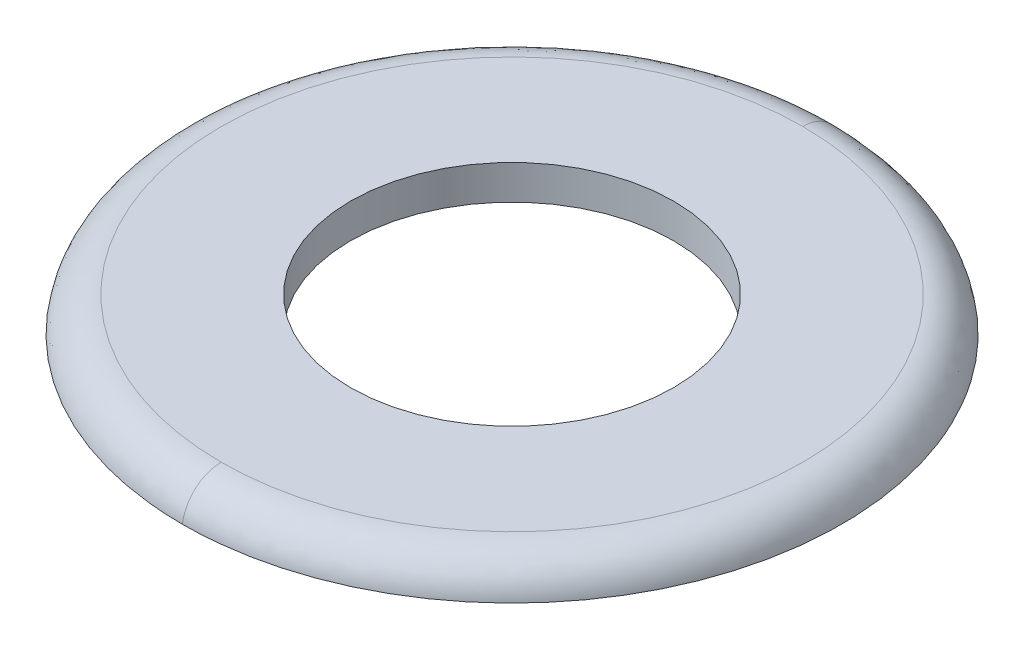
ISO-10303-21;
HEADER;
FILE_DESCRIPTION(('STEP AP214'),'2;1');
FILE_NAME('part.step','',(''),(''),'','','');
FILE_SCHEMA(('AUTOMOTIVE_DESIGN { 1 0 10303 214 1 1 1 1 }'));
ENDSEC;
DATA;
#1=APPLICATION_CONTEXT('core data for automotive mechanical design processes');
#2=APPLICATION_PROTOCOL_DEFINITION('international standard','automotive_design',2000,#1);
#3=PRODUCT_CONTEXT('',#1,'mechanical');
#4=PRODUCT('Part','Part','',(#3));
#5=PRODUCT_RELATED_PRODUCT_CATEGORY('part','',(#4));
#6=PRODUCT_DEFINITION_FORMATION('','',#4);
#7=PRODUCT_DEFINITION_CONTEXT('part definition',#1,'design');
#8=PRODUCT_DEFINITION('design','',#6,#7);
#9=PRODUCT_DEFINITION_SHAPE('','',#8);
#10=(LENGTH_UNIT() NAMED_UNIT(*) SI_UNIT(.MILLI.,.METRE.));
#11=(NAMED_UNIT(*) PLANE_ANGLE_UNIT() SI_UNIT($,.RADIAN.));
#12=(NAMED_UNIT(*) SI_UNIT($,.STERADIAN.) SOLID_ANGLE_UNIT());
#13=UNCERTAINTY_MEASURE_WITH_UNIT(LENGTH_MEASURE(1.E-05),#10,'distance_accuracy_value','');
#14=(GEOMETRIC_REPRESENTATION_CONTEXT(3) GLOBAL_UNCERTAINTY_ASSIGNED_CONTEXT((#13)) GLOBAL_UNIT_ASSIGNED_CONTEXT((#10,
#11,#12)) REPRESENTATION_CONTEXT('',''));
#15=CARTESIAN_POINT('',(0.,0.,0.));
#16=DIRECTION('',(0.,0.,1.));
#17=DIRECTION('',(1.,0.,0.));
#18=AXIS2_PLACEMENT_3D('',#15,#16,#17);
#19=CARTESIAN_POINT('',(0.,4.375679167,-5.3230343));
#20=CARTESIAN_POINT('',(10.646068599,4.375679167,-5.3230343));
#21=CARTESIAN_POINT('',(10.646068599,4.375679167,5.3230343));
#22=CARTESIAN_POINT('',(0.,4.375679167,5.3230343));
#23=CARTESIAN_POINT('',(0.,4.70848177,-5.282567789));
#24=CARTESIAN_POINT('',(10.565135578,4.70848177,-5.282567789));
#25=CARTESIAN_POINT('',(10.565135578,4.70848177,5.282567789));
#26=CARTESIAN_POINT('',(0.,4.70848177,5.282567789));
#27=CARTESIAN_POINT('',(0.,4.930775,-5.031607968));
#28=CARTESIAN_POINT('',(10.063215937,4.930775,-5.031607968));
#29=CARTESIAN_POINT('',(10.063215937,4.930775,5.031607968));
#30=CARTESIAN_POINT('',(0.,4.930775,5.031607968));
#31=CARTESIAN_POINT('',(0.,4.930775,-4.696354167));
#32=CARTESIAN_POINT('',(9.392708333,4.930775,-4.696354167));
#33=CARTESIAN_POINT('',(9.392708333,4.930775,4.696354167));
#34=CARTESIAN_POINT('',(0.,4.930775,4.696354167));
#35=(BOUNDED_SURFACE() B_SPLINE_SURFACE(3,3,((#19,#20,#21,#22),(#23,#24,#25,#26),(#27,#28,#29,
#30),(#31,#32,#33,#34)),.UNSPECIFIED.,.F.,.F.,.F.) B_SPLINE_SURFACE_WITH_KNOTS((4,4),(4,4),(0.,
1.),(0.,1.),.UNSPECIFIED.) GEOMETRIC_REPRESENTATION_ITEM() RATIONAL_B_SPLINE_SURFACE(((1.,
0.333333333333333,0.333333333333333,1.),(0.832377777422356,0.277459259140785,0.277459259140785,
0.832377777422356),(0.832377777422356,0.277459259140785,0.277459259140785,0.832377777422356),
(1.,0.333333333333333,0.333333333333333,1.))) REPRESENTATION_ITEM('') SURFACE());
#36=CARTESIAN_POINT('',(0.,4.375679167,-5.3230343));
#37=CARTESIAN_POINT('',(0.,4.70848177,-5.282567789));
#38=CARTESIAN_POINT('',(0.,4.930775,-5.031607968));
#39=CARTESIAN_POINT('',(0.,4.930775,-4.696354167));
#40=(BOUNDED_CURVE() B_SPLINE_CURVE(3,(#36,#37,#38,#39),.UNSPECIFIED.,.F.,
.F.) B_SPLINE_CURVE_WITH_KNOTS((4,4),(0.,1.),
.UNSPECIFIED.) CURVE() GEOMETRIC_REPRESENTATION_ITEM() RATIONAL_B_SPLINE_CURVE((1.,
0.832377777422356,0.832377777422356,1.)) REPRESENTATION_ITEM(''));
#41=CARTESIAN_POINT('',(0.,4.375679167,-5.3230343));
#42=VERTEX_POINT('',#41);
#43=CARTESIAN_POINT('',(0.,4.930775,-4.69635416616735));
#44=VERTEX_POINT('',#43);
#45=EDGE_CURVE('E40',#42,#44,#40,.T.);
#46=CARTESIAN_POINT('',(0.,4.930775,-4.69635416725172));
#47=CARTESIAN_POINT('',(9.39270833350345,4.930775,-4.69635416725172));
#48=CARTESIAN_POINT('',(9.39270833350345,4.930775,4.69635416725172));
#49=CARTESIAN_POINT('',(0.,4.930775,4.69635416725172));
#50=(BOUNDED_CURVE() B_SPLINE_CURVE(3,(#46,#47,#48,#49),.UNSPECIFIED.,.F.,
.F.) B_SPLINE_CURVE_WITH_KNOTS((4,4),(0.,1.),
.UNSPECIFIED.) CURVE() GEOMETRIC_REPRESENTATION_ITEM() RATIONAL_B_SPLINE_CURVE((0.999999999848797,
0.333333333282932,0.333333333282932,0.999999999848797)) REPRESENTATION_ITEM(''));
#51=CARTESIAN_POINT('',(0.,4.930775,4.69635416616735));
#52=VERTEX_POINT('',#51);
#53=EDGE_CURVE('E51',#52,#44,#50,.F.);
#54=CARTESIAN_POINT('',(0.,4.375679167,5.3230343));
#55=CARTESIAN_POINT('',(0.,4.70848177,5.282567789));
#56=CARTESIAN_POINT('',(0.,4.930775,5.031607968));
#57=CARTESIAN_POINT('',(0.,4.930775,4.696354167));
#58=(BOUNDED_CURVE() B_SPLINE_CURVE(3,(#54,#55,#56,#57),.UNSPECIFIED.,.F.,
.F.) B_SPLINE_CURVE_WITH_KNOTS((4,4),(0.,1.),
.UNSPECIFIED.) CURVE() GEOMETRIC_REPRESENTATION_ITEM() RATIONAL_B_SPLINE_CURVE((1.,
0.832377777422356,0.832377777422356,1.)) REPRESENTATION_ITEM(''));
#59=CARTESIAN_POINT('',(0.,4.375679167,5.3230343));
#60=VERTEX_POINT('',#59);
#61=EDGE_CURVE('E48',#52,#60,#58,.F.);
#62=CARTESIAN_POINT('',(0.,4.375679167,-5.3230343));
#63=CARTESIAN_POINT('',(0.212380032010998,4.375679167,-5.32307626286779));
#64=CARTESIAN_POINT('',(0.424669350881498,4.375679167,-5.31032173481795));
#65=CARTESIAN_POINT('',(0.84648815243599,4.375679167,-5.25958531587474));
#66=CARTESIAN_POINT('',(1.05601376313384,4.375679167,-5.2215712190774));
#67=CARTESIAN_POINT('',(1.55320117603685,4.375679167,-5.10016358255391));
#68=CARTESIAN_POINT('',(1.83797708442055,4.375679167,-5.00460079419376));
#69=CARTESIAN_POINT('',(2.38746843481458,4.375679167,-4.76701047839415));
#70=CARTESIAN_POINT('',(2.65217608291923,4.375679167,-4.62496501119486));
#71=CARTESIAN_POINT('',(3.15395595895447,4.375679167,-4.298465234918));
#72=CARTESIAN_POINT('',(3.39103342795736,4.375679167,-4.11401898849158));
#73=CARTESIAN_POINT('',(3.830849864425,4.375679167,-3.70794868832086));
#74=CARTESIAN_POINT('',(4.03358904684542,4.375679167,-3.48632486732329));
#75=CARTESIAN_POINT('',(4.39898727078023,4.375679167,-3.01216982523529));
#76=CARTESIAN_POINT('',(4.56164566978477,4.375679167,-2.75963810877691));
#77=CARTESIAN_POINT('',(4.84225187886002,4.375679167,-2.23090169278146));
#78=CARTESIAN_POINT('',(4.96020084226035,4.375679167,-1.95469760412495));
#79=CARTESIAN_POINT('',(5.14805795523807,4.375679167,-1.38624248787407));
#80=CARTESIAN_POINT('',(5.21796589216557,4.375679167,-1.09399138925503));
#81=CARTESIAN_POINT('',(5.2853018884877,4.375679167,-0.650221484549063));
#82=CARTESIAN_POINT('',(5.30149147786391,4.375679167,-0.501316697094672));
#83=CARTESIAN_POINT('',(5.32127439129683,4.375679167,-0.202687516736643));
#84=CARTESIAN_POINT('',(5.32487236199308,4.375679167,-0.0529634466031581));
#85=CARTESIAN_POINT('',(5.31944056028887,4.375679167,0.246300042026318));
#86=CARTESIAN_POINT('',(5.31040614421893,4.375679167,0.395839372383604));
#87=CARTESIAN_POINT('',(5.27977598713768,4.375679167,0.693572875501855));
#88=CARTESIAN_POINT('',(5.25818488346258,4.375679167,0.841767524360555));
#89=CARTESIAN_POINT('',(5.20258723458666,4.375679167,1.13586320792397));
#90=CARTESIAN_POINT('',(5.16857628154494,4.375679167,1.28176340912356));
#91=CARTESIAN_POINT('',(5.08839706143746,4.375679167,1.57012622077818));
#92=CARTESIAN_POINT('',(5.04223328586991,4.375679167,1.71259008006197));
#93=CARTESIAN_POINT('',(4.93805115632814,4.375679167,1.99317557269611));
#94=CARTESIAN_POINT('',(4.88002840025879,4.375679167,2.13129557155795));
#95=CARTESIAN_POINT('',(4.75257515228881,4.375679167,2.40210551607099));
#96=CARTESIAN_POINT('',(4.68314887837086,4.375679167,2.53479744689735));
#97=CARTESIAN_POINT('',(4.533338509798,4.375679167,2.79391129414319));
#98=CARTESIAN_POINT('',(4.45295028522023,4.375679167,2.92033082283065));
#99=CARTESIAN_POINT('',(4.28183946481926,4.375679167,3.16590156244257));
#100=CARTESIAN_POINT('',(4.19112069411752,4.375679167,3.28505543871011));
#101=CARTESIAN_POINT('',(3.99993830895782,4.375679167,3.51533639072069));
#102=CARTESIAN_POINT('',(3.89947152810036,4.375679167,3.62646083771483));
#103=CARTESIAN_POINT('',(3.68957127592284,4.375679167,3.83981038339353));
#104=CARTESIAN_POINT('',(3.58014112720931,4.375679167,3.94203875101953));
#105=CARTESIAN_POINT('',(3.35300876482704,4.375679167,4.13695928127615));
#106=CARTESIAN_POINT('',(3.23530287568556,4.375679167,4.2296471611211));
#107=CARTESIAN_POINT('',(2.99254461538695,4.375679167,4.40474293082252));
#108=CARTESIAN_POINT('',(2.86749496927131,4.375679167,4.48715459885079));
#109=CARTESIAN_POINT('',(2.61081432682289,4.375679167,4.64120253130756));
#110=CARTESIAN_POINT('',(2.47917907910112,4.375679167,4.71283171223429));
#111=CARTESIAN_POINT('',(2.21038958993492,4.375679167,4.84471621245609));
#112=CARTESIAN_POINT('',(2.07323738745459,4.375679167,4.90497568776973));
#113=CARTESIAN_POINT('',(1.79438718125458,4.375679167,5.01370652476175));
#114=CARTESIAN_POINT('',(1.65269068440821,4.375679167,5.06218174923379));
#115=CARTESIAN_POINT('',(1.36576627190808,4.375679167,5.14701480256508));
#116=CARTESIAN_POINT('',(1.22053935030704,4.375679167,5.1833760008933));
#117=CARTESIAN_POINT('',(0.897357696084527,4.375679167,5.24994674369914));
#118=CARTESIAN_POINT('',(0.718818321158585,4.375679167,5.27735036391688));
#119=CARTESIAN_POINT('',(0.360179057534496,4.375679167,5.31389795798764));
#120=CARTESIAN_POINT('',(0.180082226459222,4.375679167,5.32307195776995));
#121=CARTESIAN_POINT('',(0.,4.375679167,5.3230343));
#122=B_SPLINE_CURVE_WITH_KNOTS('',3,(#62,#63,#64,#65,#66,#67,#68,#69,#70,#71,#72,#73,#74,#75,
#76,#77,#78,#79,#80,#81,#82,#83,#84,#85,#86,#87,#88,#89,#90,#91,#92,#93,#94,#95,#96,#97,#98,#99,
#100,#101,#102,#103,#104,#105,#106,#107,#108,#109,#110,#111,#112,#113,#114,#115,#116,#117,#118,
#119,#120,#121),.UNSPECIFIED.,.F.,.F.,(4,2,2,2,2,2,2,2,2,2,2,2,2,2,2,2,2,2,2,2,2,2,2,2,2,2,2,2,
2,4),(0.,0.636583182050378,1.27397956787148,2.17065562486875,3.06767815851217,3.96453026118346,
4.86137674940548,5.75823761347524,6.65507534044719,7.55191703717657,8.00082736900272,
8.44957202359306,8.89848168023879,9.34722565431805,9.79612904397598,10.2448667581276,
10.6937713488118,11.1425102690934,11.5914187216056,12.0401614926604,12.4890505177977,
12.9377738920558,13.3866978305568,13.8354562270861,14.2845081585736,14.7333956267737,
15.1821357538441,15.6307509611948,16.1716887308236,16.7117347832057),.UNSPECIFIED.);
#123=EDGE_CURVE('E22',#42,#60,#122,.T.);
#124=ORIENTED_EDGE('',*,*,#45,.T.);
#125=ORIENTED_EDGE('',*,*,#53,.F.);
#126=ORIENTED_EDGE('',*,*,#61,.T.);
#127=ORIENTED_EDGE('',*,*,#123,.F.);
#128=EDGE_LOOP('',(#124,#125,#126,#127));
#129=FACE_BOUND('',#128,.T.);
#130=ADVANCED_FACE('F17',(#129),#35,.T.);
#131=CARTESIAN_POINT('',(0.,4.930775,0.));
#132=DIRECTION('',(0.,-1.,0.));
#133=DIRECTION('',(0.,0.,-1.));
#134=AXIS2_PLACEMENT_3D('',#131,#132,#133);
#135=CYLINDRICAL_SURFACE('',#134,2.609908356);
#136=CARTESIAN_POINT('',(0.,4.375679167,0.));
#137=DIRECTION('',(0.,-1.,0.));
#138=DIRECTION('',(0.,0.,-1.));
#139=AXIS2_PLACEMENT_3D('',#136,#137,#138);
#140=CIRCLE('',#139,2.609908356);
#141=CARTESIAN_POINT('',(0.,4.375679167,-2.609908356));
#142=VERTEX_POINT('',#141);
#143=EDGE_CURVE('E57',#142,#142,#140,.F.);
#144=ORIENTED_EDGE('',*,*,#143,.F.);
#145=EDGE_LOOP('',(#144));
#146=FACE_BOUND('',#145,.T.);
#147=CARTESIAN_POINT('',(0.,4.930775,0.));
#148=DIRECTION('',(0.,-1.,0.));
#149=DIRECTION('',(0.,0.,-1.));
#150=AXIS2_PLACEMENT_3D('',#147,#148,#149);
#151=CIRCLE('',#150,2.609908356);
#152=CARTESIAN_POINT('',(0.,4.930775,-2.609908356));
#153=VERTEX_POINT('',#152);
#154=EDGE_CURVE('E59',#153,#153,#151,.T.);
#155=ORIENTED_EDGE('',*,*,#154,.F.);
#156=EDGE_LOOP('',(#155));
#157=FACE_BOUND('',#156,.T.);
#158=ADVANCED_FACE('F77',(#146,#157),#135,.F.);
#159=CARTESIAN_POINT('',(-5.386910711,4.375679167,5.386910711));
#160=DIRECTION('',(0.,-1.,0.));
#161=DIRECTION('',(0.,0.,-1.));
#162=AXIS2_PLACEMENT_3D('',#159,#160,#161);
#163=PLANE('',#162);
#164=ORIENTED_EDGE('',*,*,#143,.T.);
#165=EDGE_LOOP('',(#164));
#166=FACE_BOUND('',#165,.T.);
#167=ORIENTED_EDGE('',*,*,#123,.T.);
#168=CARTESIAN_POINT('',(0.,4.375679167,-5.3230343));
#169=CARTESIAN_POINT('',(-0.212380032010998,4.375679167,-5.32307626286779));
#170=CARTESIAN_POINT('',(-0.424669350881498,4.375679167,-5.31032173481795));
#171=CARTESIAN_POINT('',(-0.84648815243599,4.375679167,-5.25958531587474));
#172=CARTESIAN_POINT('',(-1.05601376313384,4.375679167,-5.2215712190774));
#173=CARTESIAN_POINT('',(-1.55320117603686,4.375679167,-5.10016358255391));
#174=CARTESIAN_POINT('',(-1.83797708442055,4.375679167,-5.00460079419376));
#175=CARTESIAN_POINT('',(-2.38746843481458,4.375679167,-4.76701047839415));
#176=CARTESIAN_POINT('',(-2.65217608291923,4.375679167,-4.62496501119486));
#177=CARTESIAN_POINT('',(-3.15395595895447,4.375679167,-4.29846523491799));
#178=CARTESIAN_POINT('',(-3.39103342795737,4.375679167,-4.11401898849158));
#179=CARTESIAN_POINT('',(-3.83084986442501,4.375679167,-3.70794868832086));
#180=CARTESIAN_POINT('',(-4.03358904684542,4.375679167,-3.48632486732329));
#181=CARTESIAN_POINT('',(-4.39898727078024,4.375679167,-3.01216982523529));
#182=CARTESIAN_POINT('',(-4.56164566978477,4.375679167,-2.75963810877691));
#183=CARTESIAN_POINT('',(-4.84225187886002,4.375679167,-2.23090169278146));
#184=CARTESIAN_POINT('',(-4.96020084226035,4.375679167,-1.95469760412495));
#185=CARTESIAN_POINT('',(-5.14805795523807,4.375679167,-1.38624248787407));
#186=CARTESIAN_POINT('',(-5.21796589216557,4.375679167,-1.09399138925503));
#187=CARTESIAN_POINT('',(-5.2853018884877,4.375679167,-0.650221484549061));
#188=CARTESIAN_POINT('',(-5.30149147786391,4.375679167,-0.501316697094669));
#189=CARTESIAN_POINT('',(-5.32127439129683,4.375679167,-0.202687516736641));
#190=CARTESIAN_POINT('',(-5.32487236199308,4.375679167,-0.0529634466031555));
#191=CARTESIAN_POINT('',(-5.31944056028887,4.375679167,0.24630004202632));
#192=CARTESIAN_POINT('',(-5.31040614421894,4.375679167,0.395839372383606));
#193=CARTESIAN_POINT('',(-5.27977598713768,4.375679167,0.693572875501857));
#194=CARTESIAN_POINT('',(-5.25818488346258,4.375679167,0.841767524360556));
#195=CARTESIAN_POINT('',(-5.20258723458666,4.375679167,1.13586320792397));
#196=CARTESIAN_POINT('',(-5.16857628154494,4.375679167,1.28176340912356));
#197=CARTESIAN_POINT('',(-5.08839706143746,4.375679167,1.57012622077818));
#198=CARTESIAN_POINT('',(-5.04223328586991,4.375679167,1.71259008006197));
#199=CARTESIAN_POINT('',(-4.93805115632814,4.375679167,1.99317557269611));
#200=CARTESIAN_POINT('',(-4.88002840025878,4.375679167,2.13129557155795));
#201=CARTESIAN_POINT('',(-4.75257515228881,4.375679167,2.40210551607099));
#202=CARTESIAN_POINT('',(-4.68314887837086,4.375679167,2.53479744689735));
#203=CARTESIAN_POINT('',(-4.533338509798,4.375679167,2.79391129414319));
#204=CARTESIAN_POINT('',(-4.45295028522023,4.375679167,2.92033082283065));
#205=CARTESIAN_POINT('',(-4.28183946481926,4.375679167,3.16590156244257));
#206=CARTESIAN_POINT('',(-4.19112069411752,4.375679167,3.28505543871012));
#207=CARTESIAN_POINT('',(-3.99993830895782,4.375679167,3.51533639072069));
#208=CARTESIAN_POINT('',(-3.89947152810036,4.375679167,3.62646083771483));
#209=CARTESIAN_POINT('',(-3.68957127592283,4.375679167,3.83981038339354));
#210=CARTESIAN_POINT('',(-3.5801411272093,4.375679167,3.94203875101953));
#211=CARTESIAN_POINT('',(-3.35300876482704,4.375679167,4.13695928127616));
#212=CARTESIAN_POINT('',(-3.23530287568556,4.375679167,4.2296471611211));
#213=CARTESIAN_POINT('',(-2.99254461538694,4.375679167,4.40474293082252));
#214=CARTESIAN_POINT('',(-2.86749496927131,4.375679167,4.48715459885079));
#215=CARTESIAN_POINT('',(-2.61081432682289,4.375679167,4.64120253130756));
#216=CARTESIAN_POINT('',(-2.47917907910112,4.375679167,4.71283171223429));
#217=CARTESIAN_POINT('',(-2.21038958993492,4.375679167,4.84471621245609));
#218=CARTESIAN_POINT('',(-2.07323738745459,4.375679167,4.90497568776974));
#219=CARTESIAN_POINT('',(-1.79438718125458,4.375679167,5.01370652476176));
#220=CARTESIAN_POINT('',(-1.65269068440821,4.375679167,5.0621817492338));
#221=CARTESIAN_POINT('',(-1.36576627190808,4.375679167,5.14701480256508));
#222=CARTESIAN_POINT('',(-1.22053935030704,4.375679167,5.1833760008933));
#223=CARTESIAN_POINT('',(-0.897357696084525,4.375679167,5.24994674369914));
#224=CARTESIAN_POINT('',(-0.718818321158583,4.375679167,5.27735036391688));
#225=CARTESIAN_POINT('',(-0.360179057534495,4.375679167,5.31389795798764));
#226=CARTESIAN_POINT('',(-0.180082226459221,4.375679167,5.32307195776995));
#227=CARTESIAN_POINT('',(0.,4.375679167,5.3230343));
#228=B_SPLINE_CURVE_WITH_KNOTS('',3,(#168,#169,#170,#171,#172,#173,#174,#175,#176,#177,#178,
#179,#180,#181,#182,#183,#184,#185,#186,#187,#188,#189,#190,#191,#192,#193,#194,#195,#196,#197,
#198,#199,#200,#201,#202,#203,#204,#205,#206,#207,#208,#209,#210,#211,#212,#213,#214,#215,#216,
#217,#218,#219,#220,#221,#222,#223,#224,#225,#226,#227),.UNSPECIFIED.,.F.,.F.,(4,2,2,2,2,2,2,2,
2,2,2,2,2,2,2,2,2,2,2,2,2,2,2,2,2,2,2,2,2,4),(0.,0.636583182050377,1.27397956787148,
2.17065562486876,3.06767815851217,3.96453026118346,4.86137674940549,5.75823761347525,
6.65507534044719,7.55191703717657,8.00082736900272,8.44957202359306,8.89848168023879,
9.34722565431805,9.79612904397598,10.2448667581276,10.6937713488118,11.1425102690934,
11.5914187216056,12.0401614926604,12.4890505177977,12.9377738920558,13.3866978305569,
13.8354562270861,14.2845081585736,14.7333956267737,15.1821357538441,15.6307509611948,
16.1716887308237,16.7117347832057),.UNSPECIFIED.);
#229=EDGE_CURVE('E32',#42,#60,#228,.T.);
#230=ORIENTED_EDGE('',*,*,#229,.F.);
#231=EDGE_LOOP('',(#167,#230));
#232=FACE_BOUND('',#231,.T.);
#233=ADVANCED_FACE('F56',(#166,#232),#163,.T.);
#234=CARTESIAN_POINT('',(-4.752731025,4.930775,-4.752710417));
#235=DIRECTION('',(0.,1.,0.));
#236=DIRECTION('',(0.,0.,1.));
#237=AXIS2_PLACEMENT_3D('',#234,#235,#236);
#238=PLANE('',#237);
#239=ORIENTED_EDGE('',*,*,#154,.T.);
#240=EDGE_LOOP('',(#239));
#241=FACE_BOUND('',#240,.T.);
#242=CARTESIAN_POINT('',(0.,4.930775,4.69635416725172));
#243=CARTESIAN_POINT('',(-9.39270833350344,4.930775,4.69635416725172));
#244=CARTESIAN_POINT('',(-9.39270833350344,4.930775,-4.69635416725172));
#245=CARTESIAN_POINT('',(0.,4.930775,-4.69635416725172));
#246=(BOUNDED_CURVE() B_SPLINE_CURVE(3,(#242,#243,#244,#245),.UNSPECIFIED.,.F.,
.F.) B_SPLINE_CURVE_WITH_KNOTS((4,4),(0.,1.),
.UNSPECIFIED.) CURVE() GEOMETRIC_REPRESENTATION_ITEM() RATIONAL_B_SPLINE_CURVE((0.999999999848798,
0.333333333282932,0.333333333282932,0.999999999848798)) REPRESENTATION_ITEM(''));
#247=EDGE_CURVE('E11',#52,#44,#246,.T.);
#248=ORIENTED_EDGE('',*,*,#247,.F.);
#249=ORIENTED_EDGE('',*,*,#53,.T.);
#250=EDGE_LOOP('',(#248,#249));
#251=FACE_BOUND('',#250,.T.);
#252=ADVANCED_FACE('F19',(#241,#251),#238,.T.);
#253=CARTESIAN_POINT('',(0.,4.375679167,5.3230343));
#254=CARTESIAN_POINT('',(-10.646068599,4.375679167,5.3230343));
#255=CARTESIAN_POINT('',(-10.646068599,4.375679167,-5.3230343));
#256=CARTESIAN_POINT('',(0.,4.375679167,-5.3230343));
#257=CARTESIAN_POINT('',(0.,4.70848177,5.282567789));
#258=CARTESIAN_POINT('',(-10.565135578,4.70848177,5.282567789));
#259=CARTESIAN_POINT('',(-10.565135578,4.70848177,-5.282567789));
#260=CARTESIAN_POINT('',(0.,4.70848177,-5.282567789));
#261=CARTESIAN_POINT('',(0.,4.930775,5.031607968));
#262=CARTESIAN_POINT('',(-10.063215937,4.930775,5.031607968));
#263=CARTESIAN_POINT('',(-10.063215937,4.930775,-5.031607968));
#264=CARTESIAN_POINT('',(0.,4.930775,-5.031607968));
#265=CARTESIAN_POINT('',(0.,4.930775,4.696354167));
#266=CARTESIAN_POINT('',(-9.392708333,4.930775,4.696354167));
#267=CARTESIAN_POINT('',(-9.392708333,4.930775,-4.696354167));
#268=CARTESIAN_POINT('',(0.,4.930775,-4.696354167));
#269=(BOUNDED_SURFACE() B_SPLINE_SURFACE(3,3,((#253,#254,#255,#256),(#257,#258,#259,#260),(#261,
#262,#263,#264),(#265,#266,#267,#268)),.UNSPECIFIED.,.F.,.F.,
.F.) B_SPLINE_SURFACE_WITH_KNOTS((4,4),(4,4),(0.,1.),(0.,1.),
.UNSPECIFIED.) GEOMETRIC_REPRESENTATION_ITEM() RATIONAL_B_SPLINE_SURFACE(((1.,0.333333333333333,
0.333333333333333,1.),(0.832377777422356,0.277459259140785,0.277459259140785,0.832377777422356),
(0.832377777422356,0.277459259140785,0.277459259140785,0.832377777422356),(1.,0.333333333333333,
0.333333333333333,1.))) REPRESENTATION_ITEM('') SURFACE());
#270=ORIENTED_EDGE('',*,*,#247,.T.);
#271=ORIENTED_EDGE('',*,*,#45,.F.);
#272=ORIENTED_EDGE('',*,*,#229,.T.);
#273=ORIENTED_EDGE('',*,*,#61,.F.);
#274=EDGE_LOOP('',(#270,#271,#272,#273));
#275=FACE_BOUND('',#274,.T.);
#276=ADVANCED_FACE('F58',(#275),#269,.T.);
#277=CLOSED_SHELL('',(#130,#158,#233,#252,#276));
#278=MANIFOLD_SOLID_BREP('B1',#277);
#279=ADVANCED_BREP_SHAPE_REPRESENTATION('',(#18,#278),#14);
#280=SHAPE_DEFINITION_REPRESENTATION(#9,#279);
ENDSEC;
END-ISO-10303-21;
